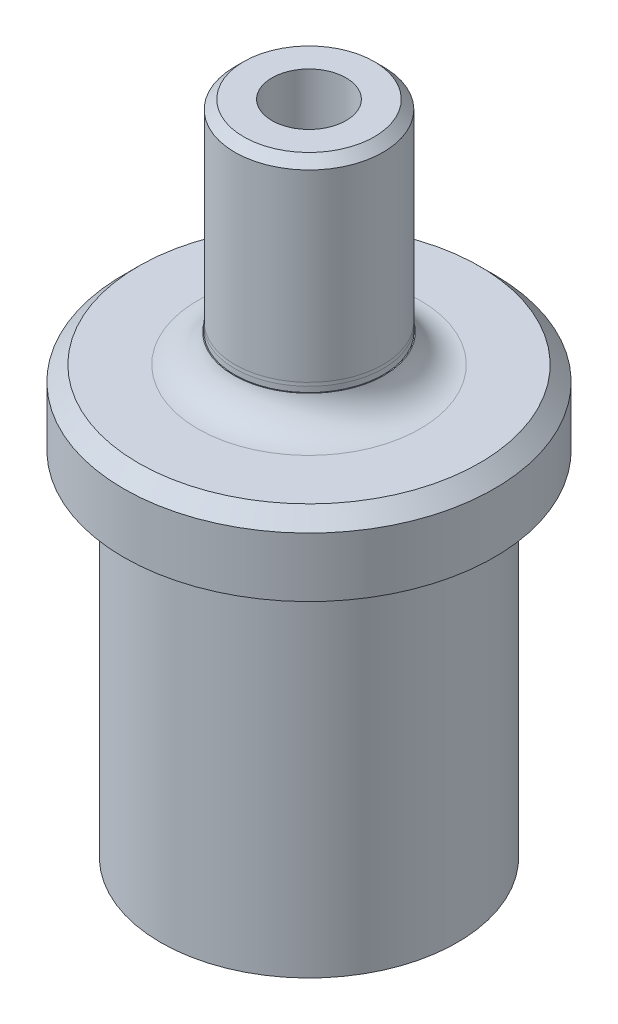
ISO-10303-21;
HEADER;
FILE_DESCRIPTION(('STEP AP214'),'2;1');
FILE_NAME('part.step','',(''),(''),'','','');
FILE_SCHEMA(('AUTOMOTIVE_DESIGN { 1 0 10303 214 1 1 1 1 }'));
ENDSEC;
DATA;
#1=APPLICATION_CONTEXT('core data for automotive mechanical design processes');
#2=APPLICATION_PROTOCOL_DEFINITION('international standard','automotive_design',2000,#1);
#3=PRODUCT_CONTEXT('',#1,'mechanical');
#4=PRODUCT('Part','Part','',(#3));
#5=PRODUCT_RELATED_PRODUCT_CATEGORY('part','',(#4));
#6=PRODUCT_DEFINITION_FORMATION('','',#4);
#7=PRODUCT_DEFINITION_CONTEXT('part definition',#1,'design');
#8=PRODUCT_DEFINITION('design','',#6,#7);
#9=PRODUCT_DEFINITION_SHAPE('','',#8);
#10=(LENGTH_UNIT() NAMED_UNIT(*) SI_UNIT(.MILLI.,.METRE.));
#11=(NAMED_UNIT(*) PLANE_ANGLE_UNIT() SI_UNIT($,.RADIAN.));
#12=(NAMED_UNIT(*) SI_UNIT($,.STERADIAN.) SOLID_ANGLE_UNIT());
#13=UNCERTAINTY_MEASURE_WITH_UNIT(LENGTH_MEASURE(1.E-05),#10,'distance_accuracy_value','');
#14=(GEOMETRIC_REPRESENTATION_CONTEXT(3) GLOBAL_UNCERTAINTY_ASSIGNED_CONTEXT((#13)) GLOBAL_UNIT_ASSIGNED_CONTEXT((#10,
#11,#12)) REPRESENTATION_CONTEXT('',''));
#15=CARTESIAN_POINT('',(0.,0.,0.));
#16=DIRECTION('',(0.,0.,1.));
#17=DIRECTION('',(1.,0.,0.));
#18=AXIS2_PLACEMENT_3D('',#15,#16,#17);
#19=CARTESIAN_POINT('',(0.,87.5665,0.));
#20=DIRECTION('',(0.,1.,0.));
#21=DIRECTION('',(0.,0.,1.));
#22=AXIS2_PLACEMENT_3D('',#19,#20,#21);
#23=CYLINDRICAL_SURFACE('',#22,1.72719999999999);
#24=CARTESIAN_POINT('',(0.,48.9775739957719,0.));
#25=DIRECTION('',(0.,1.,0.));
#26=DIRECTION('',(0.,0.,1.));
#27=AXIS2_PLACEMENT_3D('',#24,#25,#26);
#28=CIRCLE('',#27,1.72719999999999);
#29=CARTESIAN_POINT('',(0.,48.9775739957719,1.72719999999999));
#30=VERTEX_POINT('',#29);
#31=EDGE_CURVE('E367',#30,#30,#28,.T.);
#32=ORIENTED_EDGE('',*,*,#31,.T.);
#33=EDGE_LOOP('',(#32));
#34=FACE_BOUND('',#33,.T.);
#35=CARTESIAN_POINT('',(0.,19.176,0.));
#36=DIRECTION('',(0.,-1.,0.));
#37=DIRECTION('',(0.,0.,-1.));
#38=AXIS2_PLACEMENT_3D('',#35,#36,#37);
#39=CIRCLE('',#38,1.72719999999999);
#40=CARTESIAN_POINT('',(0.,19.176,-1.72719999999999));
#41=VERTEX_POINT('',#40);
#42=EDGE_CURVE('E366',#41,#41,#39,.T.);
#43=ORIENTED_EDGE('',*,*,#42,.T.);
#44=EDGE_LOOP('',(#43));
#45=FACE_BOUND('',#44,.T.);
#46=ADVANCED_FACE('F35',(#34,#45),#23,.F.);
#47=CARTESIAN_POINT('',(0.,39.6875,0.));
#48=DIRECTION('',(0.,1.,0.));
#49=DIRECTION('',(0.,0.,1.));
#50=AXIS2_PLACEMENT_3D('',#47,#48,#49);
#51=TOROIDAL_SURFACE('',#50,9.525,3.175);
#52=CARTESIAN_POINT('',(0.,36.5125,0.));
#53=DIRECTION('',(0.,1.,0.));
#54=DIRECTION('',(0.,0.,1.));
#55=AXIS2_PLACEMENT_3D('',#52,#53,#54);
#56=CIRCLE('',#55,9.525);
#57=CARTESIAN_POINT('',(0.,36.5125,9.525));
#58=VERTEX_POINT('',#57);
#59=EDGE_CURVE('E350',#58,#58,#56,.F.);
#60=ORIENTED_EDGE('',*,*,#59,.F.);
#61=EDGE_LOOP('',(#60));
#62=FACE_BOUND('',#61,.T.);
#63=CARTESIAN_POINT('',(0.,38.9382,0.));
#64=DIRECTION('',(0.,-1.,0.));
#65=DIRECTION('',(1.,0.,0.));
#66=AXIS2_PLACEMENT_3D('',#63,#64,#65);
#67=CIRCLE('',#66,6.43968405021463);
#68=CARTESIAN_POINT('',(6.43968405021463,38.9382,0.));
#69=VERTEX_POINT('',#68);
#70=EDGE_CURVE('E362',#69,#69,#67,.F.);
#71=ORIENTED_EDGE('',*,*,#70,.F.);
#72=EDGE_LOOP('',(#71));
#73=FACE_BOUND('',#72,.T.);
#74=ADVANCED_FACE('F387',(#62,#73),#51,.F.);
#75=CARTESIAN_POINT('',(0.,80.9625,0.));
#76=DIRECTION('',(0.,-1.,0.));
#77=DIRECTION('',(0.,0.,-1.));
#78=AXIS2_PLACEMENT_3D('',#75,#76,#77);
#79=CYLINDRICAL_SURFACE('',#78,15.875);
#80=CARTESIAN_POINT('',(0.,35.2425,0.));
#81=DIRECTION('',(0.,1.,0.));
#82=DIRECTION('',(0.,0.,1.));
#83=AXIS2_PLACEMENT_3D('',#80,#81,#82);
#84=CIRCLE('',#83,15.875);
#85=CARTESIAN_POINT('',(0.,35.2425,15.875));
#86=VERTEX_POINT('',#85);
#87=EDGE_CURVE('E356',#86,#86,#84,.F.);
#88=ORIENTED_EDGE('',*,*,#87,.T.);
#89=EDGE_LOOP('',(#88));
#90=FACE_BOUND('',#89,.T.);
#91=CARTESIAN_POINT('',(0.,30.1625,0.));
#92=DIRECTION('',(0.,1.,0.));
#93=DIRECTION('',(0.,0.,1.));
#94=AXIS2_PLACEMENT_3D('',#91,#92,#93);
#95=CIRCLE('',#94,15.875);
#96=CARTESIAN_POINT('',(0.,30.1625,15.875));
#97=VERTEX_POINT('',#96);
#98=EDGE_CURVE('E297',#97,#97,#95,.T.);
#99=ORIENTED_EDGE('',*,*,#98,.T.);
#100=EDGE_LOOP('',(#99));
#101=FACE_BOUND('',#100,.T.);
#102=ADVANCED_FACE('F393',(#90,#101),#79,.T.);
#103=CARTESIAN_POINT('',(0.,0.,0.));
#104=DIRECTION('',(0.,1.,0.));
#105=DIRECTION('',(0.,0.,1.));
#106=AXIS2_PLACEMENT_3D('',#103,#104,#105);
#107=PLANE('',#106);
#108=CARTESIAN_POINT('',(0.,0.,0.));
#109=DIRECTION('',(0.,1.,0.));
#110=DIRECTION('',(0.,0.,1.));
#111=AXIS2_PLACEMENT_3D('',#108,#109,#110);
#112=CIRCLE('',#111,12.7);
#113=CARTESIAN_POINT('',(0.,0.,12.7));
#114=VERTEX_POINT('',#113);
#115=EDGE_CURVE('E341',#114,#114,#112,.T.);
#116=ORIENTED_EDGE('',*,*,#115,.F.);
#117=EDGE_LOOP('',(#116));
#118=FACE_BOUND('',#117,.T.);
#119=DIRECTION('',(0.707106781186548,0.,0.707106781186547));
#120=VECTOR('',#119,1.);
#121=CARTESIAN_POINT('',(-4.94974746830584,0.,4.94974746830584));
#122=LINE('',#121,#120);
#123=CARTESIAN_POINT('',(-8.77696292147802,0.,1.12253201513365));
#124=VERTEX_POINT('',#123);
#125=CARTESIAN_POINT('',(-7.,0.,2.89949493661167));
#126=VERTEX_POINT('',#125);
#127=EDGE_CURVE('E50',#124,#126,#122,.T.);
#128=ORIENTED_EDGE('',*,*,#127,.T.);
#129=DIRECTION('',(0.,0.,1.));
#130=VECTOR('',#129,1.);
#131=CARTESIAN_POINT('',(-7.,0.,0.));
#132=LINE('',#131,#130);
#133=CARTESIAN_POINT('',(-7.,0.,5.4125));
#134=VERTEX_POINT('',#133);
#135=EDGE_CURVE('E136',#126,#134,#132,.T.);
#136=ORIENTED_EDGE('',*,*,#135,.T.);
#137=CARTESIAN_POINT('',(-5.4125,0.,5.4125));
#138=DIRECTION('',(0.,-1.,0.));
#139=DIRECTION('',(0.,0.,-1.));
#140=AXIS2_PLACEMENT_3D('',#137,#138,#139);
#141=CIRCLE('',#140,1.5875);
#142=CARTESIAN_POINT('',(-5.4125,0.,7.));
#143=VERTEX_POINT('',#142);
#144=EDGE_CURVE('E291',#143,#134,#141,.T.);
#145=ORIENTED_EDGE('',*,*,#144,.F.);
#146=DIRECTION('',(1.,0.,0.));
#147=VECTOR('',#146,1.);
#148=CARTESIAN_POINT('',(0.,0.,7.));
#149=LINE('',#148,#147);
#150=CARTESIAN_POINT('',(-2.89949493661167,0.,7.));
#151=VERTEX_POINT('',#150);
#152=EDGE_CURVE('E208',#143,#151,#149,.T.);
#153=ORIENTED_EDGE('',*,*,#152,.T.);
#154=DIRECTION('',(0.707106781186548,0.,0.707106781186547));
#155=VECTOR('',#154,1.);
#156=CARTESIAN_POINT('',(-4.94974746830584,0.,4.94974746830584));
#157=LINE('',#156,#155);
#158=CARTESIAN_POINT('',(-1.12253201513365,0.,8.77696292147802));
#159=VERTEX_POINT('',#158);
#160=EDGE_CURVE('E287',#151,#159,#157,.T.);
#161=ORIENTED_EDGE('',*,*,#160,.T.);
#162=CARTESIAN_POINT('',(0.,0.,7.65443090634438));
#163=DIRECTION('',(0.,-1.,0.));
#164=DIRECTION('',(0.,0.,-1.));
#165=AXIS2_PLACEMENT_3D('',#162,#163,#164);
#166=CIRCLE('',#165,1.5875);
#167=CARTESIAN_POINT('',(1.12253201513365,0.,8.77696292147801));
#168=VERTEX_POINT('',#167);
#169=EDGE_CURVE('E284',#168,#159,#166,.T.);
#170=ORIENTED_EDGE('',*,*,#169,.F.);
#171=DIRECTION('',(0.707106781186548,0.,-0.707106781186548));
#172=VECTOR('',#171,1.);
#173=CARTESIAN_POINT('',(4.94974746830583,0.,4.94974746830583));
#174=LINE('',#173,#172);
#175=CARTESIAN_POINT('',(2.89949493661166,0.,7.));
#176=VERTEX_POINT('',#175);
#177=EDGE_CURVE('E281',#168,#176,#174,.T.);
#178=ORIENTED_EDGE('',*,*,#177,.T.);
#179=DIRECTION('',(1.,0.,0.));
#180=VECTOR('',#179,1.);
#181=CARTESIAN_POINT('',(0.,0.,7.));
#182=LINE('',#181,#180);
#183=CARTESIAN_POINT('',(5.4125,0.,7.));
#184=VERTEX_POINT('',#183);
#185=EDGE_CURVE('E278',#176,#184,#182,.T.);
#186=ORIENTED_EDGE('',*,*,#185,.T.);
#187=CARTESIAN_POINT('',(5.4125,0.,5.4125));
#188=DIRECTION('',(0.,-1.,0.));
#189=DIRECTION('',(0.,0.,-1.));
#190=AXIS2_PLACEMENT_3D('',#187,#188,#189);
#191=CIRCLE('',#190,1.5875);
#192=CARTESIAN_POINT('',(7.,0.,5.4125));
#193=VERTEX_POINT('',#192);
#194=EDGE_CURVE('E275',#193,#184,#191,.T.);
#195=ORIENTED_EDGE('',*,*,#194,.F.);
#196=DIRECTION('',(0.,0.,1.));
#197=VECTOR('',#196,1.);
#198=CARTESIAN_POINT('',(7.,0.,0.));
#199=LINE('',#198,#197);
#200=CARTESIAN_POINT('',(7.,0.,2.89949493661167));
#201=VERTEX_POINT('',#200);
#202=EDGE_CURVE('E272',#201,#193,#199,.T.);
#203=ORIENTED_EDGE('',*,*,#202,.F.);
#204=DIRECTION('',(0.707106781186548,0.,-0.707106781186548));
#205=VECTOR('',#204,1.);
#206=CARTESIAN_POINT('',(4.94974746830583,0.,4.94974746830583));
#207=LINE('',#206,#205);
#208=CARTESIAN_POINT('',(8.77696292147802,0.,1.12253201513365));
#209=VERTEX_POINT('',#208);
#210=EDGE_CURVE('E269',#201,#209,#207,.T.);
#211=ORIENTED_EDGE('',*,*,#210,.T.);
#212=CARTESIAN_POINT('',(7.65443090634438,0.,0.));
#213=DIRECTION('',(0.,-1.,0.));
#214=DIRECTION('',(0.,0.,-1.));
#215=AXIS2_PLACEMENT_3D('',#212,#213,#214);
#216=CIRCLE('',#215,1.5875);
#217=CARTESIAN_POINT('',(8.77696292147801,0.,-1.12253201513364));
#218=VERTEX_POINT('',#217);
#219=EDGE_CURVE('E266',#218,#209,#216,.T.);
#220=ORIENTED_EDGE('',*,*,#219,.F.);
#221=DIRECTION('',(0.707106781186548,0.,0.707106781186548));
#222=VECTOR('',#221,1.);
#223=CARTESIAN_POINT('',(4.94974746830583,0.,-4.94974746830583));
#224=LINE('',#223,#222);
#225=CARTESIAN_POINT('',(7.,0.,-2.89949493661165));
#226=VERTEX_POINT('',#225);
#227=EDGE_CURVE('E263',#226,#218,#224,.T.);
#228=ORIENTED_EDGE('',*,*,#227,.F.);
#229=DIRECTION('',(0.,0.,1.));
#230=VECTOR('',#229,1.);
#231=CARTESIAN_POINT('',(7.,0.,0.));
#232=LINE('',#231,#230);
#233=CARTESIAN_POINT('',(7.,0.,-5.4125));
#234=VERTEX_POINT('',#233);
#235=EDGE_CURVE('E260',#234,#226,#232,.T.);
#236=ORIENTED_EDGE('',*,*,#235,.F.);
#237=CARTESIAN_POINT('',(5.4125,0.,-5.4125));
#238=DIRECTION('',(0.,-1.,0.));
#239=DIRECTION('',(0.,0.,-1.));
#240=AXIS2_PLACEMENT_3D('',#237,#238,#239);
#241=CIRCLE('',#240,1.5875);
#242=CARTESIAN_POINT('',(5.4125,0.,-7.));
#243=VERTEX_POINT('',#242);
#244=EDGE_CURVE('E257',#243,#234,#241,.T.);
#245=ORIENTED_EDGE('',*,*,#244,.F.);
#246=DIRECTION('',(1.,0.,0.));
#247=VECTOR('',#246,1.);
#248=CARTESIAN_POINT('',(0.,0.,-7.));
#249=LINE('',#248,#247);
#250=CARTESIAN_POINT('',(2.89949493661166,0.,-7.));
#251=VERTEX_POINT('',#250);
#252=EDGE_CURVE('E254',#251,#243,#249,.T.);
#253=ORIENTED_EDGE('',*,*,#252,.F.);
#254=DIRECTION('',(0.707106781186548,0.,0.707106781186548));
#255=VECTOR('',#254,1.);
#256=CARTESIAN_POINT('',(4.94974746830583,0.,-4.94974746830583));
#257=LINE('',#256,#255);
#258=CARTESIAN_POINT('',(1.12253201513364,0.,-8.77696292147802));
#259=VERTEX_POINT('',#258);
#260=EDGE_CURVE('E251',#259,#251,#257,.T.);
#261=ORIENTED_EDGE('',*,*,#260,.F.);
#262=CARTESIAN_POINT('',(0.,0.,-7.65443090634438));
#263=DIRECTION('',(0.,-1.,0.));
#264=DIRECTION('',(0.,0.,-1.));
#265=AXIS2_PLACEMENT_3D('',#262,#263,#264);
#266=CIRCLE('',#265,1.5875);
#267=CARTESIAN_POINT('',(-1.12253201513365,0.,-8.77696292147802));
#268=VERTEX_POINT('',#267);
#269=EDGE_CURVE('E248',#268,#259,#266,.T.);
#270=ORIENTED_EDGE('',*,*,#269,.F.);
#271=DIRECTION('',(0.707106781186547,0.,-0.707106781186548));
#272=VECTOR('',#271,1.);
#273=CARTESIAN_POINT('',(-4.94974746830583,0.,-4.94974746830583));
#274=LINE('',#273,#272);
#275=CARTESIAN_POINT('',(-2.89949493661167,0.,-7.));
#276=VERTEX_POINT('',#275);
#277=EDGE_CURVE('E245',#276,#268,#274,.T.);
#278=ORIENTED_EDGE('',*,*,#277,.F.);
#279=DIRECTION('',(1.,0.,0.));
#280=VECTOR('',#279,1.);
#281=CARTESIAN_POINT('',(0.,0.,-7.));
#282=LINE('',#281,#280);
#283=CARTESIAN_POINT('',(-5.4125,0.,-7.));
#284=VERTEX_POINT('',#283);
#285=EDGE_CURVE('E242',#284,#276,#282,.T.);
#286=ORIENTED_EDGE('',*,*,#285,.F.);
#287=CARTESIAN_POINT('',(-5.4125,0.,-5.4125));
#288=DIRECTION('',(0.,-1.,0.));
#289=DIRECTION('',(0.,0.,-1.));
#290=AXIS2_PLACEMENT_3D('',#287,#288,#289);
#291=CIRCLE('',#290,1.5875);
#292=CARTESIAN_POINT('',(-7.,0.,-5.4125));
#293=VERTEX_POINT('',#292);
#294=EDGE_CURVE('E239',#293,#284,#291,.T.);
#295=ORIENTED_EDGE('',*,*,#294,.F.);
#296=DIRECTION('',(0.,0.,1.));
#297=VECTOR('',#296,1.);
#298=CARTESIAN_POINT('',(-7.,0.,0.));
#299=LINE('',#298,#297);
#300=CARTESIAN_POINT('',(-7.,0.,-2.89949493661167));
#301=VERTEX_POINT('',#300);
#302=EDGE_CURVE('E236',#293,#301,#299,.T.);
#303=ORIENTED_EDGE('',*,*,#302,.T.);
#304=DIRECTION('',(0.707106781186547,0.,-0.707106781186548));
#305=VECTOR('',#304,1.);
#306=CARTESIAN_POINT('',(-4.94974746830583,0.,-4.94974746830583));
#307=LINE('',#306,#305);
#308=CARTESIAN_POINT('',(-8.77696292147803,0.,-1.12253201513364));
#309=VERTEX_POINT('',#308);
#310=EDGE_CURVE('E233',#309,#301,#307,.T.);
#311=ORIENTED_EDGE('',*,*,#310,.F.);
#312=CARTESIAN_POINT('',(-7.65443090634438,0.,0.));
#313=DIRECTION('',(0.,-1.,0.));
#314=DIRECTION('',(0.,0.,-1.));
#315=AXIS2_PLACEMENT_3D('',#312,#313,#314);
#316=CIRCLE('',#315,1.5875);
#317=EDGE_CURVE('E229',#124,#309,#316,.T.);
#318=ORIENTED_EDGE('',*,*,#317,.F.);
#319=EDGE_LOOP('',(#128,#136,#145,#153,#161,#170,#178,#186,#195,#203,#211,#220,#228,#236,#245,
#253,#261,#270,#278,#286,#295,#303,#311,#318));
#320=FACE_BOUND('',#319,.T.);
#321=ADVANCED_FACE('F510',(#118,#320),#107,.F.);
#322=CARTESIAN_POINT('',(0.,30.1625,0.));
#323=DIRECTION('',(0.,-1.,0.));
#324=DIRECTION('',(0.,0.,-1.));
#325=AXIS2_PLACEMENT_3D('',#322,#323,#324);
#326=CYLINDRICAL_SURFACE('',#325,12.7);
#327=CARTESIAN_POINT('',(0.,30.1625,0.));
#328=DIRECTION('',(0.,1.,0.));
#329=DIRECTION('',(0.,0.,1.));
#330=AXIS2_PLACEMENT_3D('',#327,#328,#329);
#331=CIRCLE('',#330,12.7);
#332=CARTESIAN_POINT('',(0.,30.1625,12.7));
#333=VERTEX_POINT('',#332);
#334=EDGE_CURVE('E342',#333,#333,#331,.T.);
#335=ORIENTED_EDGE('',*,*,#334,.F.);
#336=EDGE_LOOP('',(#335));
#337=FACE_BOUND('',#336,.T.);
#338=ORIENTED_EDGE('',*,*,#115,.T.);
#339=EDGE_LOOP('',(#338));
#340=FACE_BOUND('',#339,.T.);
#341=ADVANCED_FACE('F506',(#337,#340),#326,.T.);
#342=CARTESIAN_POINT('',(0.,30.1625,0.));
#343=DIRECTION('',(0.,1.,0.));
#344=DIRECTION('',(0.,0.,1.));
#345=AXIS2_PLACEMENT_3D('',#342,#343,#344);
#346=PLANE('',#345);
#347=ORIENTED_EDGE('',*,*,#334,.T.);
#348=EDGE_LOOP('',(#347));
#349=FACE_BOUND('',#348,.T.);
#350=ORIENTED_EDGE('',*,*,#98,.F.);
#351=EDGE_LOOP('',(#350));
#352=FACE_BOUND('',#351,.T.);
#353=ADVANCED_FACE('F503',(#349,#352),#346,.F.);
#354=CARTESIAN_POINT('',(-4.94974746830584,11.176,4.94974746830584));
#355=DIRECTION('',(0.707106781186548,0.,-0.707106781186548));
#356=DIRECTION('',(-0.707106781186548,0.,-0.707106781186547));
#357=AXIS2_PLACEMENT_3D('',#354,#355,#356);
#358=PLANE('',#357);
#359=ORIENTED_EDGE('',*,*,#127,.F.);
#360=DIRECTION('',(0.,-1.,0.));
#361=VECTOR('',#360,1.);
#362=CARTESIAN_POINT('',(-8.77696292147802,11.176,1.12253201513365));
#363=LINE('',#362,#361);
#364=CARTESIAN_POINT('',(-8.77696292147802,11.176,1.12253201513365));
#365=VERTEX_POINT('',#364);
#366=EDGE_CURVE('E139',#365,#124,#363,.T.);
#367=ORIENTED_EDGE('',*,*,#366,.F.);
#368=DIRECTION('',(0.707106781186548,0.,0.707106781186547));
#369=VECTOR('',#368,1.);
#370=CARTESIAN_POINT('',(-4.94974746830584,11.176,4.94974746830584));
#371=LINE('',#370,#369);
#372=CARTESIAN_POINT('',(-7.,11.176,2.89949493661167));
#373=VERTEX_POINT('',#372);
#374=EDGE_CURVE('E294',#365,#373,#371,.T.);
#375=ORIENTED_EDGE('',*,*,#374,.T.);
#376=DIRECTION('',(0.,-1.,0.));
#377=VECTOR('',#376,1.);
#378=CARTESIAN_POINT('',(-7.,11.176,2.89949493661167));
#379=LINE('',#378,#377);
#380=EDGE_CURVE('E295',#373,#126,#379,.T.);
#381=ORIENTED_EDGE('',*,*,#380,.T.);
#382=EDGE_LOOP('',(#359,#367,#375,#381));
#383=FACE_BOUND('',#382,.T.);
#384=ADVANCED_FACE('F417',(#383),#358,.T.);
#385=CARTESIAN_POINT('',(-7.,11.176,0.));
#386=DIRECTION('',(1.,0.,0.));
#387=DIRECTION('',(0.,0.,-1.));
#388=AXIS2_PLACEMENT_3D('',#385,#386,#387);
#389=PLANE('',#388);
#390=ORIENTED_EDGE('',*,*,#135,.F.);
#391=ORIENTED_EDGE('',*,*,#380,.F.);
#392=DIRECTION('',(0.,0.,1.));
#393=VECTOR('',#392,1.);
#394=CARTESIAN_POINT('',(-7.,11.176,0.));
#395=LINE('',#394,#393);
#396=CARTESIAN_POINT('',(-7.,11.176,5.4125));
#397=VERTEX_POINT('',#396);
#398=EDGE_CURVE('E59',#373,#397,#395,.T.);
#399=ORIENTED_EDGE('',*,*,#398,.T.);
#400=DIRECTION('',(0.,-1.,0.));
#401=VECTOR('',#400,1.);
#402=CARTESIAN_POINT('',(-7.,11.176,5.4125));
#403=LINE('',#402,#401);
#404=EDGE_CURVE('E213',#397,#134,#403,.T.);
#405=ORIENTED_EDGE('',*,*,#404,.T.);
#406=EDGE_LOOP('',(#390,#391,#399,#405));
#407=FACE_BOUND('',#406,.T.);
#408=ADVANCED_FACE('F414',(#407),#389,.T.);
#409=CARTESIAN_POINT('',(-5.4125,11.176,5.4125));
#410=DIRECTION('',(0.,-1.,0.));
#411=DIRECTION('',(0.,0.,-1.));
#412=AXIS2_PLACEMENT_3D('',#409,#410,#411);
#413=CYLINDRICAL_SURFACE('',#412,1.5875);
#414=ORIENTED_EDGE('',*,*,#144,.T.);
#415=ORIENTED_EDGE('',*,*,#404,.F.);
#416=CARTESIAN_POINT('',(-5.4125,11.176,5.4125));
#417=DIRECTION('',(0.,-1.,0.));
#418=DIRECTION('',(0.,0.,-1.));
#419=AXIS2_PLACEMENT_3D('',#416,#417,#418);
#420=CIRCLE('',#419,1.5875);
#421=CARTESIAN_POINT('',(-5.4125,11.176,7.));
#422=VERTEX_POINT('',#421);
#423=EDGE_CURVE('E218',#422,#397,#420,.T.);
#424=ORIENTED_EDGE('',*,*,#423,.F.);
#425=DIRECTION('',(0.,-1.,0.));
#426=VECTOR('',#425,1.);
#427=CARTESIAN_POINT('',(-5.4125,11.176,7.));
#428=LINE('',#427,#426);
#429=EDGE_CURVE('E202',#422,#143,#428,.T.);
#430=ORIENTED_EDGE('',*,*,#429,.T.);
#431=EDGE_LOOP('',(#414,#415,#424,#430));
#432=FACE_BOUND('',#431,.T.);
#433=ADVANCED_FACE('F223',(#432),#413,.F.);
#434=CARTESIAN_POINT('',(0.,11.176,7.));
#435=DIRECTION('',(0.,0.,-1.));
#436=DIRECTION('',(-1.,0.,0.));
#437=AXIS2_PLACEMENT_3D('',#434,#435,#436);
#438=PLANE('',#437);
#439=ORIENTED_EDGE('',*,*,#152,.F.);
#440=ORIENTED_EDGE('',*,*,#429,.F.);
#441=DIRECTION('',(1.,0.,0.));
#442=VECTOR('',#441,1.);
#443=CARTESIAN_POINT('',(0.,11.176,7.));
#444=LINE('',#443,#442);
#445=CARTESIAN_POINT('',(-2.89949493661167,11.176,7.));
#446=VERTEX_POINT('',#445);
#447=EDGE_CURVE('E205',#422,#446,#444,.T.);
#448=ORIENTED_EDGE('',*,*,#447,.T.);
#449=DIRECTION('',(0.,-1.,0.));
#450=VECTOR('',#449,1.);
#451=CARTESIAN_POINT('',(-2.89949493661167,11.176,7.));
#452=LINE('',#451,#450);
#453=EDGE_CURVE('E214',#446,#151,#452,.T.);
#454=ORIENTED_EDGE('',*,*,#453,.T.);
#455=EDGE_LOOP('',(#439,#440,#448,#454));
#456=FACE_BOUND('',#455,.T.);
#457=ADVANCED_FACE('F204',(#456),#438,.T.);
#458=CARTESIAN_POINT('',(-4.94974746830584,11.176,4.94974746830584));
#459=DIRECTION('',(0.707106781186548,0.,-0.707106781186548));
#460=DIRECTION('',(-0.707106781186548,0.,-0.707106781186547));
#461=AXIS2_PLACEMENT_3D('',#458,#459,#460);
#462=PLANE('',#461);
#463=ORIENTED_EDGE('',*,*,#160,.F.);
#464=ORIENTED_EDGE('',*,*,#453,.F.);
#465=DIRECTION('',(0.707106781186548,0.,0.707106781186547));
#466=VECTOR('',#465,1.);
#467=CARTESIAN_POINT('',(-4.94974746830584,11.176,4.94974746830584));
#468=LINE('',#467,#466);
#469=CARTESIAN_POINT('',(-1.12253201513365,11.176,8.77696292147802));
#470=VERTEX_POINT('',#469);
#471=EDGE_CURVE('E220',#446,#470,#468,.T.);
#472=ORIENTED_EDGE('',*,*,#471,.T.);
#473=DIRECTION('',(0.,-1.,0.));
#474=VECTOR('',#473,1.);
#475=CARTESIAN_POINT('',(-1.12253201513365,11.176,8.77696292147802));
#476=LINE('',#475,#474);
#477=EDGE_CURVE('E300',#470,#159,#476,.T.);
#478=ORIENTED_EDGE('',*,*,#477,.T.);
#479=EDGE_LOOP('',(#463,#464,#472,#478));
#480=FACE_BOUND('',#479,.T.);
#481=ADVANCED_FACE('F422',(#480),#462,.T.);
#482=CARTESIAN_POINT('',(0.,11.176,7.65443090634438));
#483=DIRECTION('',(0.,-1.,0.));
#484=DIRECTION('',(0.,0.,-1.));
#485=AXIS2_PLACEMENT_3D('',#482,#483,#484);
#486=CYLINDRICAL_SURFACE('',#485,1.5875);
#487=ORIENTED_EDGE('',*,*,#169,.T.);
#488=ORIENTED_EDGE('',*,*,#477,.F.);
#489=CARTESIAN_POINT('',(0.,11.176,7.65443090634438));
#490=DIRECTION('',(0.,-1.,0.));
#491=DIRECTION('',(0.,0.,-1.));
#492=AXIS2_PLACEMENT_3D('',#489,#490,#491);
#493=CIRCLE('',#492,1.5875);
#494=CARTESIAN_POINT('',(1.12253201513365,11.176,8.77696292147801));
#495=VERTEX_POINT('',#494);
#496=EDGE_CURVE('E909',#495,#470,#493,.T.);
#497=ORIENTED_EDGE('',*,*,#496,.F.);
#498=DIRECTION('',(0.,-1.,0.));
#499=VECTOR('',#498,1.);
#500=CARTESIAN_POINT('',(1.12253201513365,11.176,8.77696292147801));
#501=LINE('',#500,#499);
#502=EDGE_CURVE('E302',#495,#168,#501,.T.);
#503=ORIENTED_EDGE('',*,*,#502,.T.);
#504=EDGE_LOOP('',(#487,#488,#497,#503));
#505=FACE_BOUND('',#504,.T.);
#506=ADVANCED_FACE('F425',(#505),#486,.F.);
#507=CARTESIAN_POINT('',(4.94974746830583,11.176,4.94974746830583));
#508=DIRECTION('',(-0.707106781186548,0.,-0.707106781186548));
#509=DIRECTION('',(-0.707106781186548,0.,0.707106781186548));
#510=AXIS2_PLACEMENT_3D('',#507,#508,#509);
#511=PLANE('',#510);
#512=ORIENTED_EDGE('',*,*,#177,.F.);
#513=ORIENTED_EDGE('',*,*,#502,.F.);
#514=DIRECTION('',(0.707106781186548,0.,-0.707106781186548));
#515=VECTOR('',#514,1.);
#516=CARTESIAN_POINT('',(4.94974746830583,11.176,4.94974746830583));
#517=LINE('',#516,#515);
#518=CARTESIAN_POINT('',(2.89949493661166,11.176,7.));
#519=VERTEX_POINT('',#518);
#520=EDGE_CURVE('E907',#495,#519,#517,.T.);
#521=ORIENTED_EDGE('',*,*,#520,.T.);
#522=DIRECTION('',(0.,-1.,0.));
#523=VECTOR('',#522,1.);
#524=CARTESIAN_POINT('',(2.89949493661166,11.176,7.));
#525=LINE('',#524,#523);
#526=EDGE_CURVE('E304',#519,#176,#525,.T.);
#527=ORIENTED_EDGE('',*,*,#526,.T.);
#528=EDGE_LOOP('',(#512,#513,#521,#527));
#529=FACE_BOUND('',#528,.T.);
#530=ADVANCED_FACE('F429',(#529),#511,.T.);
#531=CARTESIAN_POINT('',(0.,11.176,7.));
#532=DIRECTION('',(0.,0.,-1.));
#533=DIRECTION('',(-1.,0.,0.));
#534=AXIS2_PLACEMENT_3D('',#531,#532,#533);
#535=PLANE('',#534);
#536=ORIENTED_EDGE('',*,*,#185,.F.);
#537=ORIENTED_EDGE('',*,*,#526,.F.);
#538=DIRECTION('',(1.,0.,0.));
#539=VECTOR('',#538,1.);
#540=CARTESIAN_POINT('',(0.,11.176,7.));
#541=LINE('',#540,#539);
#542=CARTESIAN_POINT('',(5.4125,11.176,7.));
#543=VERTEX_POINT('',#542);
#544=EDGE_CURVE('E905',#519,#543,#541,.T.);
#545=ORIENTED_EDGE('',*,*,#544,.T.);
#546=DIRECTION('',(0.,-1.,0.));
#547=VECTOR('',#546,1.);
#548=CARTESIAN_POINT('',(5.4125,11.176,7.));
#549=LINE('',#548,#547);
#550=EDGE_CURVE('E306',#543,#184,#549,.T.);
#551=ORIENTED_EDGE('',*,*,#550,.T.);
#552=EDGE_LOOP('',(#536,#537,#545,#551));
#553=FACE_BOUND('',#552,.T.);
#554=ADVANCED_FACE('F433',(#553),#535,.T.);
#555=CARTESIAN_POINT('',(5.4125,11.176,5.4125));
#556=DIRECTION('',(0.,-1.,0.));
#557=DIRECTION('',(0.,0.,-1.));
#558=AXIS2_PLACEMENT_3D('',#555,#556,#557);
#559=CYLINDRICAL_SURFACE('',#558,1.5875);
#560=ORIENTED_EDGE('',*,*,#194,.T.);
#561=ORIENTED_EDGE('',*,*,#550,.F.);
#562=CARTESIAN_POINT('',(5.4125,11.176,5.4125));
#563=DIRECTION('',(0.,-1.,0.));
#564=DIRECTION('',(0.,0.,-1.));
#565=AXIS2_PLACEMENT_3D('',#562,#563,#564);
#566=CIRCLE('',#565,1.5875);
#567=CARTESIAN_POINT('',(7.,11.176,5.4125));
#568=VERTEX_POINT('',#567);
#569=EDGE_CURVE('E902',#568,#543,#566,.T.);
#570=ORIENTED_EDGE('',*,*,#569,.F.);
#571=DIRECTION('',(0.,-1.,0.));
#572=VECTOR('',#571,1.);
#573=CARTESIAN_POINT('',(7.,11.176,5.4125));
#574=LINE('',#573,#572);
#575=EDGE_CURVE('E308',#568,#193,#574,.T.);
#576=ORIENTED_EDGE('',*,*,#575,.T.);
#577=EDGE_LOOP('',(#560,#561,#570,#576));
#578=FACE_BOUND('',#577,.T.);
#579=ADVANCED_FACE('F437',(#578),#559,.F.);
#580=CARTESIAN_POINT('',(7.,11.176,0.));
#581=DIRECTION('',(1.,0.,0.));
#582=DIRECTION('',(0.,0.,-1.));
#583=AXIS2_PLACEMENT_3D('',#580,#581,#582);
#584=PLANE('',#583);
#585=ORIENTED_EDGE('',*,*,#202,.T.);
#586=ORIENTED_EDGE('',*,*,#575,.F.);
#587=DIRECTION('',(0.,0.,1.));
#588=VECTOR('',#587,1.);
#589=CARTESIAN_POINT('',(7.,11.176,0.));
#590=LINE('',#589,#588);
#591=CARTESIAN_POINT('',(7.,11.176,2.89949493661167));
#592=VERTEX_POINT('',#591);
#593=EDGE_CURVE('E899',#592,#568,#590,.T.);
#594=ORIENTED_EDGE('',*,*,#593,.F.);
#595=DIRECTION('',(0.,-1.,0.));
#596=VECTOR('',#595,1.);
#597=CARTESIAN_POINT('',(7.,11.176,2.89949493661167));
#598=LINE('',#597,#596);
#599=EDGE_CURVE('E310',#592,#201,#598,.T.);
#600=ORIENTED_EDGE('',*,*,#599,.T.);
#601=EDGE_LOOP('',(#585,#586,#594,#600));
#602=FACE_BOUND('',#601,.T.);
#603=ADVANCED_FACE('F441',(#602),#584,.F.);
#604=CARTESIAN_POINT('',(4.94974746830583,11.176,4.94974746830583));
#605=DIRECTION('',(-0.707106781186548,0.,-0.707106781186548));
#606=DIRECTION('',(-0.707106781186548,0.,0.707106781186548));
#607=AXIS2_PLACEMENT_3D('',#604,#605,#606);
#608=PLANE('',#607);
#609=ORIENTED_EDGE('',*,*,#210,.F.);
#610=ORIENTED_EDGE('',*,*,#599,.F.);
#611=DIRECTION('',(0.707106781186548,0.,-0.707106781186548));
#612=VECTOR('',#611,1.);
#613=CARTESIAN_POINT('',(4.94974746830583,11.176,4.94974746830583));
#614=LINE('',#613,#612);
#615=CARTESIAN_POINT('',(8.77696292147802,11.176,1.12253201513365));
#616=VERTEX_POINT('',#615);
#617=EDGE_CURVE('E897',#592,#616,#614,.T.);
#618=ORIENTED_EDGE('',*,*,#617,.T.);
#619=DIRECTION('',(0.,-1.,0.));
#620=VECTOR('',#619,1.);
#621=CARTESIAN_POINT('',(8.77696292147802,11.176,1.12253201513365));
#622=LINE('',#621,#620);
#623=EDGE_CURVE('E312',#616,#209,#622,.T.);
#624=ORIENTED_EDGE('',*,*,#623,.T.);
#625=EDGE_LOOP('',(#609,#610,#618,#624));
#626=FACE_BOUND('',#625,.T.);
#627=ADVANCED_FACE('F445',(#626),#608,.T.);
#628=CARTESIAN_POINT('',(7.65443090634438,11.176,0.));
#629=DIRECTION('',(0.,-1.,0.));
#630=DIRECTION('',(0.,0.,-1.));
#631=AXIS2_PLACEMENT_3D('',#628,#629,#630);
#632=CYLINDRICAL_SURFACE('',#631,1.5875);
#633=ORIENTED_EDGE('',*,*,#219,.T.);
#634=ORIENTED_EDGE('',*,*,#623,.F.);
#635=CARTESIAN_POINT('',(7.65443090634438,11.176,0.));
#636=DIRECTION('',(0.,-1.,0.));
#637=DIRECTION('',(0.,0.,-1.));
#638=AXIS2_PLACEMENT_3D('',#635,#636,#637);
#639=CIRCLE('',#638,1.5875);
#640=CARTESIAN_POINT('',(8.77696292147801,11.176,-1.12253201513364));
#641=VERTEX_POINT('',#640);
#642=EDGE_CURVE('E894',#641,#616,#639,.T.);
#643=ORIENTED_EDGE('',*,*,#642,.F.);
#644=DIRECTION('',(0.,-1.,0.));
#645=VECTOR('',#644,1.);
#646=CARTESIAN_POINT('',(8.77696292147801,11.176,-1.12253201513364));
#647=LINE('',#646,#645);
#648=EDGE_CURVE('E314',#641,#218,#647,.T.);
#649=ORIENTED_EDGE('',*,*,#648,.T.);
#650=EDGE_LOOP('',(#633,#634,#643,#649));
#651=FACE_BOUND('',#650,.T.);
#652=ADVANCED_FACE('F449',(#651),#632,.F.);
#653=CARTESIAN_POINT('',(4.94974746830583,11.176,-4.94974746830583));
#654=DIRECTION('',(0.707106781186548,0.,-0.707106781186548));
#655=DIRECTION('',(-0.707106781186548,0.,-0.707106781186548));
#656=AXIS2_PLACEMENT_3D('',#653,#654,#655);
#657=PLANE('',#656);
#658=ORIENTED_EDGE('',*,*,#227,.T.);
#659=ORIENTED_EDGE('',*,*,#648,.F.);
#660=DIRECTION('',(0.707106781186548,0.,0.707106781186548));
#661=VECTOR('',#660,1.);
#662=CARTESIAN_POINT('',(4.94974746830583,11.176,-4.94974746830583));
#663=LINE('',#662,#661);
#664=CARTESIAN_POINT('',(7.,11.176,-2.89949493661165));
#665=VERTEX_POINT('',#664);
#666=EDGE_CURVE('E891',#665,#641,#663,.T.);
#667=ORIENTED_EDGE('',*,*,#666,.F.);
#668=DIRECTION('',(0.,-1.,0.));
#669=VECTOR('',#668,1.);
#670=CARTESIAN_POINT('',(7.,11.176,-2.89949493661165));
#671=LINE('',#670,#669);
#672=EDGE_CURVE('E316',#665,#226,#671,.T.);
#673=ORIENTED_EDGE('',*,*,#672,.T.);
#674=EDGE_LOOP('',(#658,#659,#667,#673));
#675=FACE_BOUND('',#674,.T.);
#676=ADVANCED_FACE('F453',(#675),#657,.F.);
#677=CARTESIAN_POINT('',(7.,11.176,0.));
#678=DIRECTION('',(1.,0.,0.));
#679=DIRECTION('',(0.,0.,-1.));
#680=AXIS2_PLACEMENT_3D('',#677,#678,#679);
#681=PLANE('',#680);
#682=ORIENTED_EDGE('',*,*,#235,.T.);
#683=ORIENTED_EDGE('',*,*,#672,.F.);
#684=DIRECTION('',(0.,0.,1.));
#685=VECTOR('',#684,1.);
#686=CARTESIAN_POINT('',(7.,11.176,0.));
#687=LINE('',#686,#685);
#688=CARTESIAN_POINT('',(7.,11.176,-5.4125));
#689=VERTEX_POINT('',#688);
#690=EDGE_CURVE('E888',#689,#665,#687,.T.);
#691=ORIENTED_EDGE('',*,*,#690,.F.);
#692=DIRECTION('',(0.,-1.,0.));
#693=VECTOR('',#692,1.);
#694=CARTESIAN_POINT('',(7.,11.176,-5.4125));
#695=LINE('',#694,#693);
#696=EDGE_CURVE('E318',#689,#234,#695,.T.);
#697=ORIENTED_EDGE('',*,*,#696,.T.);
#698=EDGE_LOOP('',(#682,#683,#691,#697));
#699=FACE_BOUND('',#698,.T.);
#700=ADVANCED_FACE('F457',(#699),#681,.F.);
#701=CARTESIAN_POINT('',(5.4125,11.176,-5.4125));
#702=DIRECTION('',(0.,-1.,0.));
#703=DIRECTION('',(0.,0.,-1.));
#704=AXIS2_PLACEMENT_3D('',#701,#702,#703);
#705=CYLINDRICAL_SURFACE('',#704,1.5875);
#706=ORIENTED_EDGE('',*,*,#244,.T.);
#707=ORIENTED_EDGE('',*,*,#696,.F.);
#708=CARTESIAN_POINT('',(5.4125,11.176,-5.4125));
#709=DIRECTION('',(0.,-1.,0.));
#710=DIRECTION('',(0.,0.,-1.));
#711=AXIS2_PLACEMENT_3D('',#708,#709,#710);
#712=CIRCLE('',#711,1.5875);
#713=CARTESIAN_POINT('',(5.4125,11.176,-7.));
#714=VERTEX_POINT('',#713);
#715=EDGE_CURVE('E885',#714,#689,#712,.T.);
#716=ORIENTED_EDGE('',*,*,#715,.F.);
#717=DIRECTION('',(0.,-1.,0.));
#718=VECTOR('',#717,1.);
#719=CARTESIAN_POINT('',(5.4125,11.176,-7.));
#720=LINE('',#719,#718);
#721=EDGE_CURVE('E320',#714,#243,#720,.T.);
#722=ORIENTED_EDGE('',*,*,#721,.T.);
#723=EDGE_LOOP('',(#706,#707,#716,#722));
#724=FACE_BOUND('',#723,.T.);
#725=ADVANCED_FACE('F461',(#724),#705,.F.);
#726=CARTESIAN_POINT('',(0.,11.176,-7.));
#727=DIRECTION('',(0.,0.,-1.));
#728=DIRECTION('',(-1.,0.,0.));
#729=AXIS2_PLACEMENT_3D('',#726,#727,#728);
#730=PLANE('',#729);
#731=ORIENTED_EDGE('',*,*,#252,.T.);
#732=ORIENTED_EDGE('',*,*,#721,.F.);
#733=DIRECTION('',(1.,0.,0.));
#734=VECTOR('',#733,1.);
#735=CARTESIAN_POINT('',(0.,11.176,-7.));
#736=LINE('',#735,#734);
#737=CARTESIAN_POINT('',(2.89949493661166,11.176,-7.));
#738=VERTEX_POINT('',#737);
#739=EDGE_CURVE('E882',#738,#714,#736,.T.);
#740=ORIENTED_EDGE('',*,*,#739,.F.);
#741=DIRECTION('',(0.,-1.,0.));
#742=VECTOR('',#741,1.);
#743=CARTESIAN_POINT('',(2.89949493661166,11.176,-7.));
#744=LINE('',#743,#742);
#745=EDGE_CURVE('E322',#738,#251,#744,.T.);
#746=ORIENTED_EDGE('',*,*,#745,.T.);
#747=EDGE_LOOP('',(#731,#732,#740,#746));
#748=FACE_BOUND('',#747,.T.);
#749=ADVANCED_FACE('F465',(#748),#730,.F.);
#750=CARTESIAN_POINT('',(4.94974746830583,11.176,-4.94974746830583));
#751=DIRECTION('',(0.707106781186548,0.,-0.707106781186548));
#752=DIRECTION('',(-0.707106781186548,0.,-0.707106781186548));
#753=AXIS2_PLACEMENT_3D('',#750,#751,#752);
#754=PLANE('',#753);
#755=ORIENTED_EDGE('',*,*,#260,.T.);
#756=ORIENTED_EDGE('',*,*,#745,.F.);
#757=DIRECTION('',(0.707106781186548,0.,0.707106781186548));
#758=VECTOR('',#757,1.);
#759=CARTESIAN_POINT('',(4.94974746830583,11.176,-4.94974746830583));
#760=LINE('',#759,#758);
#761=CARTESIAN_POINT('',(1.12253201513364,11.176,-8.77696292147802));
#762=VERTEX_POINT('',#761);
#763=EDGE_CURVE('E879',#762,#738,#760,.T.);
#764=ORIENTED_EDGE('',*,*,#763,.F.);
#765=DIRECTION('',(0.,-1.,0.));
#766=VECTOR('',#765,1.);
#767=CARTESIAN_POINT('',(1.12253201513364,11.176,-8.77696292147802));
#768=LINE('',#767,#766);
#769=EDGE_CURVE('E324',#762,#259,#768,.T.);
#770=ORIENTED_EDGE('',*,*,#769,.T.);
#771=EDGE_LOOP('',(#755,#756,#764,#770));
#772=FACE_BOUND('',#771,.T.);
#773=ADVANCED_FACE('F469',(#772),#754,.F.);
#774=CARTESIAN_POINT('',(0.,11.176,-7.65443090634438));
#775=DIRECTION('',(0.,-1.,0.));
#776=DIRECTION('',(0.,0.,-1.));
#777=AXIS2_PLACEMENT_3D('',#774,#775,#776);
#778=CYLINDRICAL_SURFACE('',#777,1.5875);
#779=ORIENTED_EDGE('',*,*,#269,.T.);
#780=ORIENTED_EDGE('',*,*,#769,.F.);
#781=CARTESIAN_POINT('',(0.,11.176,-7.65443090634438));
#782=DIRECTION('',(0.,-1.,0.));
#783=DIRECTION('',(0.,0.,-1.));
#784=AXIS2_PLACEMENT_3D('',#781,#782,#783);
#785=CIRCLE('',#784,1.5875);
#786=CARTESIAN_POINT('',(-1.12253201513365,11.176,-8.77696292147802));
#787=VERTEX_POINT('',#786);
#788=EDGE_CURVE('E876',#787,#762,#785,.T.);
#789=ORIENTED_EDGE('',*,*,#788,.F.);
#790=DIRECTION('',(0.,-1.,0.));
#791=VECTOR('',#790,1.);
#792=CARTESIAN_POINT('',(-1.12253201513365,11.176,-8.77696292147802));
#793=LINE('',#792,#791);
#794=EDGE_CURVE('E326',#787,#268,#793,.T.);
#795=ORIENTED_EDGE('',*,*,#794,.T.);
#796=EDGE_LOOP('',(#779,#780,#789,#795));
#797=FACE_BOUND('',#796,.T.);
#798=ADVANCED_FACE('F473',(#797),#778,.F.);
#799=CARTESIAN_POINT('',(-4.94974746830583,11.176,-4.94974746830583));
#800=DIRECTION('',(-0.707106781186548,0.,-0.707106781186548));
#801=DIRECTION('',(-0.707106781186547,0.,0.707106781186548));
#802=AXIS2_PLACEMENT_3D('',#799,#800,#801);
#803=PLANE('',#802);
#804=ORIENTED_EDGE('',*,*,#277,.T.);
#805=ORIENTED_EDGE('',*,*,#794,.F.);
#806=DIRECTION('',(0.707106781186547,0.,-0.707106781186548));
#807=VECTOR('',#806,1.);
#808=CARTESIAN_POINT('',(-4.94974746830583,11.176,-4.94974746830583));
#809=LINE('',#808,#807);
#810=CARTESIAN_POINT('',(-2.89949493661167,11.176,-7.));
#811=VERTEX_POINT('',#810);
#812=EDGE_CURVE('E873',#811,#787,#809,.T.);
#813=ORIENTED_EDGE('',*,*,#812,.F.);
#814=DIRECTION('',(0.,-1.,0.));
#815=VECTOR('',#814,1.);
#816=CARTESIAN_POINT('',(-2.89949493661167,11.176,-7.));
#817=LINE('',#816,#815);
#818=EDGE_CURVE('E328',#811,#276,#817,.T.);
#819=ORIENTED_EDGE('',*,*,#818,.T.);
#820=EDGE_LOOP('',(#804,#805,#813,#819));
#821=FACE_BOUND('',#820,.T.);
#822=ADVANCED_FACE('F477',(#821),#803,.F.);
#823=CARTESIAN_POINT('',(0.,11.176,-7.));
#824=DIRECTION('',(0.,0.,-1.));
#825=DIRECTION('',(-1.,0.,0.));
#826=AXIS2_PLACEMENT_3D('',#823,#824,#825);
#827=PLANE('',#826);
#828=ORIENTED_EDGE('',*,*,#285,.T.);
#829=ORIENTED_EDGE('',*,*,#818,.F.);
#830=DIRECTION('',(1.,0.,0.));
#831=VECTOR('',#830,1.);
#832=CARTESIAN_POINT('',(0.,11.176,-7.));
#833=LINE('',#832,#831);
#834=CARTESIAN_POINT('',(-5.4125,11.176,-7.));
#835=VERTEX_POINT('',#834);
#836=EDGE_CURVE('E870',#835,#811,#833,.T.);
#837=ORIENTED_EDGE('',*,*,#836,.F.);
#838=DIRECTION('',(0.,-1.,0.));
#839=VECTOR('',#838,1.);
#840=CARTESIAN_POINT('',(-5.4125,11.176,-7.));
#841=LINE('',#840,#839);
#842=EDGE_CURVE('E330',#835,#284,#841,.T.);
#843=ORIENTED_EDGE('',*,*,#842,.T.);
#844=EDGE_LOOP('',(#828,#829,#837,#843));
#845=FACE_BOUND('',#844,.T.);
#846=ADVANCED_FACE('F481',(#845),#827,.F.);
#847=CARTESIAN_POINT('',(-5.4125,11.176,-5.4125));
#848=DIRECTION('',(0.,-1.,0.));
#849=DIRECTION('',(0.,0.,-1.));
#850=AXIS2_PLACEMENT_3D('',#847,#848,#849);
#851=CYLINDRICAL_SURFACE('',#850,1.5875);
#852=ORIENTED_EDGE('',*,*,#294,.T.);
#853=ORIENTED_EDGE('',*,*,#842,.F.);
#854=CARTESIAN_POINT('',(-5.4125,11.176,-5.4125));
#855=DIRECTION('',(0.,-1.,0.));
#856=DIRECTION('',(0.,0.,-1.));
#857=AXIS2_PLACEMENT_3D('',#854,#855,#856);
#858=CIRCLE('',#857,1.5875);
#859=CARTESIAN_POINT('',(-7.,11.176,-5.4125));
#860=VERTEX_POINT('',#859);
#861=EDGE_CURVE('E867',#860,#835,#858,.T.);
#862=ORIENTED_EDGE('',*,*,#861,.F.);
#863=DIRECTION('',(0.,-1.,0.));
#864=VECTOR('',#863,1.);
#865=CARTESIAN_POINT('',(-7.,11.176,-5.4125));
#866=LINE('',#865,#864);
#867=EDGE_CURVE('E332',#860,#293,#866,.T.);
#868=ORIENTED_EDGE('',*,*,#867,.T.);
#869=EDGE_LOOP('',(#852,#853,#862,#868));
#870=FACE_BOUND('',#869,.T.);
#871=ADVANCED_FACE('F485',(#870),#851,.F.);
#872=CARTESIAN_POINT('',(-7.,11.176,0.));
#873=DIRECTION('',(1.,0.,0.));
#874=DIRECTION('',(0.,0.,-1.));
#875=AXIS2_PLACEMENT_3D('',#872,#873,#874);
#876=PLANE('',#875);
#877=ORIENTED_EDGE('',*,*,#302,.F.);
#878=ORIENTED_EDGE('',*,*,#867,.F.);
#879=DIRECTION('',(0.,0.,1.));
#880=VECTOR('',#879,1.);
#881=CARTESIAN_POINT('',(-7.,11.176,0.));
#882=LINE('',#881,#880);
#883=CARTESIAN_POINT('',(-7.,11.176,-2.89949493661167));
#884=VERTEX_POINT('',#883);
#885=EDGE_CURVE('E865',#860,#884,#882,.T.);
#886=ORIENTED_EDGE('',*,*,#885,.T.);
#887=DIRECTION('',(0.,-1.,0.));
#888=VECTOR('',#887,1.);
#889=CARTESIAN_POINT('',(-7.,11.176,-2.89949493661167));
#890=LINE('',#889,#888);
#891=EDGE_CURVE('E334',#884,#301,#890,.T.);
#892=ORIENTED_EDGE('',*,*,#891,.T.);
#893=EDGE_LOOP('',(#877,#878,#886,#892));
#894=FACE_BOUND('',#893,.T.);
#895=ADVANCED_FACE('F489',(#894),#876,.T.);
#896=CARTESIAN_POINT('',(-4.94974746830583,11.176,-4.94974746830583));
#897=DIRECTION('',(-0.707106781186548,0.,-0.707106781186548));
#898=DIRECTION('',(-0.707106781186547,0.,0.707106781186548));
#899=AXIS2_PLACEMENT_3D('',#896,#897,#898);
#900=PLANE('',#899);
#901=ORIENTED_EDGE('',*,*,#310,.T.);
#902=ORIENTED_EDGE('',*,*,#891,.F.);
#903=DIRECTION('',(0.707106781186547,0.,-0.707106781186548));
#904=VECTOR('',#903,1.);
#905=CARTESIAN_POINT('',(-4.94974746830583,11.176,-4.94974746830583));
#906=LINE('',#905,#904);
#907=CARTESIAN_POINT('',(-8.77696292147803,11.176,-1.12253201513364));
#908=VERTEX_POINT('',#907);
#909=EDGE_CURVE('E862',#908,#884,#906,.T.);
#910=ORIENTED_EDGE('',*,*,#909,.F.);
#911=DIRECTION('',(0.,-1.,0.));
#912=VECTOR('',#911,1.);
#913=CARTESIAN_POINT('',(-8.77696292147803,11.176,-1.12253201513364));
#914=LINE('',#913,#912);
#915=EDGE_CURVE('E336',#908,#309,#914,.T.);
#916=ORIENTED_EDGE('',*,*,#915,.T.);
#917=EDGE_LOOP('',(#901,#902,#910,#916));
#918=FACE_BOUND('',#917,.T.);
#919=ADVANCED_FACE('F493',(#918),#900,.F.);
#920=CARTESIAN_POINT('',(-7.65443090634438,11.176,0.));
#921=DIRECTION('',(0.,-1.,0.));
#922=DIRECTION('',(0.,0.,-1.));
#923=AXIS2_PLACEMENT_3D('',#920,#921,#922);
#924=CYLINDRICAL_SURFACE('',#923,1.5875);
#925=ORIENTED_EDGE('',*,*,#317,.T.);
#926=ORIENTED_EDGE('',*,*,#915,.F.);
#927=CARTESIAN_POINT('',(-7.65443090634438,11.176,0.));
#928=DIRECTION('',(0.,-1.,0.));
#929=DIRECTION('',(0.,0.,-1.));
#930=AXIS2_PLACEMENT_3D('',#927,#928,#929);
#931=CIRCLE('',#930,1.5875);
#932=EDGE_CURVE('E859',#365,#908,#931,.T.);
#933=ORIENTED_EDGE('',*,*,#932,.F.);
#934=ORIENTED_EDGE('',*,*,#366,.T.);
#935=EDGE_LOOP('',(#925,#926,#933,#934));
#936=FACE_BOUND('',#935,.T.);
#937=ADVANCED_FACE('F412',(#936),#924,.F.);
#938=CARTESIAN_POINT('',(0.,11.176,0.));
#939=DIRECTION('',(0.,-1.,0.));
#940=DIRECTION('',(0.,0.,-1.));
#941=AXIS2_PLACEMENT_3D('',#938,#939,#940);
#942=PLANE('',#941);
#943=CARTESIAN_POINT('',(0.,11.176,0.));
#944=DIRECTION('',(0.,-1.,0.));
#945=DIRECTION('',(0.,0.,-1.));
#946=AXIS2_PLACEMENT_3D('',#943,#944,#945);
#947=CIRCLE('',#946,6.);
#948=CARTESIAN_POINT('',(0.,11.176,-6.));
#949=VERTEX_POINT('',#948);
#950=EDGE_CURVE('E853',#949,#949,#947,.T.);
#951=ORIENTED_EDGE('',*,*,#950,.F.);
#952=EDGE_LOOP('',(#951));
#953=FACE_BOUND('',#952,.T.);
#954=ORIENTED_EDGE('',*,*,#374,.F.);
#955=ORIENTED_EDGE('',*,*,#932,.T.);
#956=ORIENTED_EDGE('',*,*,#909,.T.);
#957=ORIENTED_EDGE('',*,*,#885,.F.);
#958=ORIENTED_EDGE('',*,*,#861,.T.);
#959=ORIENTED_EDGE('',*,*,#836,.T.);
#960=ORIENTED_EDGE('',*,*,#812,.T.);
#961=ORIENTED_EDGE('',*,*,#788,.T.);
#962=ORIENTED_EDGE('',*,*,#763,.T.);
#963=ORIENTED_EDGE('',*,*,#739,.T.);
#964=ORIENTED_EDGE('',*,*,#715,.T.);
#965=ORIENTED_EDGE('',*,*,#690,.T.);
#966=ORIENTED_EDGE('',*,*,#666,.T.);
#967=ORIENTED_EDGE('',*,*,#642,.T.);
#968=ORIENTED_EDGE('',*,*,#617,.F.);
#969=ORIENTED_EDGE('',*,*,#593,.T.);
#970=ORIENTED_EDGE('',*,*,#569,.T.);
#971=ORIENTED_EDGE('',*,*,#544,.F.);
#972=ORIENTED_EDGE('',*,*,#520,.F.);
#973=ORIENTED_EDGE('',*,*,#496,.T.);
#974=ORIENTED_EDGE('',*,*,#471,.F.);
#975=ORIENTED_EDGE('',*,*,#447,.F.);
#976=ORIENTED_EDGE('',*,*,#423,.T.);
#977=ORIENTED_EDGE('',*,*,#398,.F.);
#978=EDGE_LOOP('',(#954,#955,#956,#957,#958,#959,#960,#961,#962,#963,#964,#965,#966,#967,#968,
#969,#970,#971,#972,#973,#974,#975,#976,#977));
#979=FACE_BOUND('',#978,.T.);
#980=ADVANCED_FACE('F217',(#953,#979),#942,.T.);
#981=CARTESIAN_POINT('',(0.,19.176,0.));
#982=DIRECTION('',(0.,-1.,0.));
#983=DIRECTION('',(0.,0.,-1.));
#984=AXIS2_PLACEMENT_3D('',#981,#982,#983);
#985=CYLINDRICAL_SURFACE('',#984,6.);
#986=CARTESIAN_POINT('',(0.,19.176,0.));
#987=DIRECTION('',(0.,-1.,0.));
#988=DIRECTION('',(0.,0.,-1.));
#989=AXIS2_PLACEMENT_3D('',#986,#987,#988);
#990=CIRCLE('',#989,6.);
#991=CARTESIAN_POINT('',(0.,19.176,-6.));
#992=VERTEX_POINT('',#991);
#993=EDGE_CURVE('E230',#992,#992,#990,.T.);
#994=ORIENTED_EDGE('',*,*,#993,.F.);
#995=EDGE_LOOP('',(#994));
#996=FACE_BOUND('',#995,.T.);
#997=ORIENTED_EDGE('',*,*,#950,.T.);
#998=EDGE_LOOP('',(#997));
#999=FACE_BOUND('',#998,.T.);
#1000=ADVANCED_FACE('F405',(#996,#999),#985,.F.);
#1001=CARTESIAN_POINT('',(0.,19.176,0.));
#1002=DIRECTION('',(0.,-1.,0.));
#1003=DIRECTION('',(0.,0.,-1.));
#1004=AXIS2_PLACEMENT_3D('',#1001,#1002,#1003);
#1005=PLANE('',#1004);
#1006=ORIENTED_EDGE('',*,*,#42,.F.);
#1007=EDGE_LOOP('',(#1006));
#1008=FACE_BOUND('',#1007,.T.);
#1009=ORIENTED_EDGE('',*,*,#993,.T.);
#1010=EDGE_LOOP('',(#1009));
#1011=FACE_BOUND('',#1010,.T.);
#1012=ADVANCED_FACE('F402',(#1008,#1011),#1005,.T.);
#1013=CARTESIAN_POINT('',(0.,36.5125,0.));
#1014=DIRECTION('',(0.,1.,0.));
#1015=DIRECTION('',(0.,0.,1.));
#1016=AXIS2_PLACEMENT_3D('',#1013,#1014,#1015);
#1017=PLANE('',#1016);
#1018=CARTESIAN_POINT('',(0.,36.5125,0.));
#1019=DIRECTION('',(0.,1.,0.));
#1020=DIRECTION('',(0.,0.,1.));
#1021=AXIS2_PLACEMENT_3D('',#1018,#1019,#1020);
#1022=CIRCLE('',#1021,14.605);
#1023=CARTESIAN_POINT('',(0.,36.5125,14.605));
#1024=VERTEX_POINT('',#1023);
#1025=EDGE_CURVE('E353',#1024,#1024,#1022,.T.);
#1026=ORIENTED_EDGE('',*,*,#1025,.T.);
#1027=EDGE_LOOP('',(#1026));
#1028=FACE_BOUND('',#1027,.T.);
#1029=ORIENTED_EDGE('',*,*,#59,.T.);
#1030=EDGE_LOOP('',(#1029));
#1031=FACE_BOUND('',#1030,.T.);
#1032=ADVANCED_FACE('F400',(#1028,#1031),#1017,.T.);
#1033=CARTESIAN_POINT('',(0.,36.5125,0.));
#1034=DIRECTION('',(0.,-1.,0.));
#1035=DIRECTION('',(0.,0.,-1.));
#1036=AXIS2_PLACEMENT_3D('',#1033,#1034,#1035);
#1037=CONICAL_SURFACE('',#1036,14.605,0.785398163397443);
#1038=ORIENTED_EDGE('',*,*,#87,.F.);
#1039=EDGE_LOOP('',(#1038));
#1040=FACE_BOUND('',#1039,.T.);
#1041=ORIENTED_EDGE('',*,*,#1025,.F.);
#1042=EDGE_LOOP('',(#1041));
#1043=FACE_BOUND('',#1042,.T.);
#1044=ADVANCED_FACE('F517',(#1040,#1043),#1037,.T.);
#1045=CARTESIAN_POINT('',(0.,87.5665,0.));
#1046=DIRECTION('',(0.,1.,0.));
#1047=DIRECTION('',(-1.,0.,0.));
#1048=AXIS2_PLACEMENT_3D('',#1045,#1046,#1047);
#1049=CYLINDRICAL_SURFACE('',#1048,6.3627);
#1050=CARTESIAN_POINT('',(0.,38.9382,0.));
#1051=DIRECTION('',(0.,1.,0.));
#1052=DIRECTION('',(-1.,0.,0.));
#1053=AXIS2_PLACEMENT_3D('',#1050,#1051,#1052);
#1054=CIRCLE('',#1053,6.3627);
#1055=CARTESIAN_POINT('',(-6.36269999999999,38.9382,0.));
#1056=VERTEX_POINT('',#1055);
#1057=EDGE_CURVE('E363',#1056,#1056,#1054,.T.);
#1058=ORIENTED_EDGE('',*,*,#1057,.T.);
#1059=EDGE_LOOP('',(#1058));
#1060=FACE_BOUND('',#1059,.T.);
#1061=CARTESIAN_POINT('',(0.,39.4038034896231,0.));
#1062=DIRECTION('',(0.,1.,0.));
#1063=DIRECTION('',(0.,0.,1.));
#1064=AXIS2_PLACEMENT_3D('',#1061,#1062,#1063);
#1065=CIRCLE('',#1064,6.3627);
#1066=CARTESIAN_POINT('',(0.,39.4038034896231,6.3627));
#1067=VERTEX_POINT('',#1066);
#1068=EDGE_CURVE('E359',#1067,#1067,#1065,.F.);
#1069=ORIENTED_EDGE('',*,*,#1068,.T.);
#1070=EDGE_LOOP('',(#1069));
#1071=FACE_BOUND('',#1070,.T.);
#1072=ADVANCED_FACE('F519',(#1060,#1071),#1049,.T.);
#1073=CARTESIAN_POINT('',(0.,38.9382,0.));
#1074=DIRECTION('',(0.,1.,0.));
#1075=DIRECTION('',(-1.,0.,0.));
#1076=AXIS2_PLACEMENT_3D('',#1073,#1074,#1075);
#1077=PLANE('',#1076);
#1078=ORIENTED_EDGE('',*,*,#1057,.F.);
#1079=EDGE_LOOP('',(#1078));
#1080=FACE_BOUND('',#1079,.T.);
#1081=ORIENTED_EDGE('',*,*,#70,.T.);
#1082=EDGE_LOOP('',(#1081));
#1083=FACE_BOUND('',#1082,.T.);
#1084=ADVANCED_FACE('F525',(#1080,#1083),#1077,.T.);
#1085=CARTESIAN_POINT('',(0.,56.1975,0.));
#1086=DIRECTION('',(0.,1.,0.));
#1087=DIRECTION('',(-1.,0.,0.));
#1088=AXIS2_PLACEMENT_3D('',#1085,#1086,#1087);
#1089=PLANE('',#1088);
#1090=CARTESIAN_POINT('',(0.,56.1975,0.));
#1091=DIRECTION('',(0.,1.,0.));
#1092=DIRECTION('',(-1.,0.,0.));
#1093=AXIS2_PLACEMENT_3D('',#1090,#1091,#1092);
#1094=CIRCLE('',#1093,5.58799999999996);
#1095=CARTESIAN_POINT('',(-5.58799999999996,56.1975,0.));
#1096=VERTEX_POINT('',#1095);
#1097=EDGE_CURVE('E11',#1096,#1096,#1094,.T.);
#1098=ORIENTED_EDGE('',*,*,#1097,.T.);
#1099=EDGE_LOOP('',(#1098));
#1100=FACE_BOUND('',#1099,.T.);
#1101=CARTESIAN_POINT('',(0.,56.1975,0.));
#1102=DIRECTION('',(0.,1.,0.));
#1103=DIRECTION('',(0.,0.,1.));
#1104=AXIS2_PLACEMENT_3D('',#1101,#1102,#1103);
#1105=CIRCLE('',#1104,3.17499999999999);
#1106=CARTESIAN_POINT('',(0.,56.1975,3.17499999999999));
#1107=VERTEX_POINT('',#1106);
#1108=EDGE_CURVE('E844',#1107,#1107,#1105,.T.);
#1109=ORIENTED_EDGE('',*,*,#1108,.F.);
#1110=EDGE_LOOP('',(#1109));
#1111=FACE_BOUND('',#1110,.T.);
#1112=ADVANCED_FACE('F538',(#1100,#1111),#1089,.T.);
#1113=CARTESIAN_POINT('',(0.,39.6875,0.));
#1114=DIRECTION('',(0.,1.,0.));
#1115=DIRECTION('',(0.,0.,1.));
#1116=AXIS2_PLACEMENT_3D('',#1113,#1114,#1115);
#1117=CIRCLE('',#1116,6.35);
#1118=CARTESIAN_POINT('',(0.,39.6875,6.35));
#1119=VERTEX_POINT('',#1118);
#1120=EDGE_CURVE('E345',#1119,#1119,#1117,.T.);
#1121=ORIENTED_EDGE('',*,*,#1120,.F.);
#1122=EDGE_LOOP('',(#1121));
#1123=FACE_BOUND('',#1122,.T.);
#1124=ORIENTED_EDGE('',*,*,#1068,.F.);
#1125=EDGE_LOOP('',(#1124));
#1126=FACE_BOUND('',#1125,.T.);
#1127=ADVANCED_FACE('F396',(#1123,#1126),#51,.F.);
#1128=CARTESIAN_POINT('',(0.,36.5125,0.));
#1129=DIRECTION('',(0.,1.,0.));
#1130=DIRECTION('',(0.,0.,1.));
#1131=AXIS2_PLACEMENT_3D('',#1128,#1129,#1130);
#1132=CYLINDRICAL_SURFACE('',#1131,6.35);
#1133=CARTESIAN_POINT('',(0.,55.4354999999999,0.));
#1134=DIRECTION('',(0.,1.,0.));
#1135=DIRECTION('',(0.,0.,1.));
#1136=AXIS2_PLACEMENT_3D('',#1133,#1134,#1135);
#1137=CIRCLE('',#1136,6.35);
#1138=CARTESIAN_POINT('',(0.,55.4354999999999,6.35));
#1139=VERTEX_POINT('',#1138);
#1140=EDGE_CURVE('E43',#1139,#1139,#1137,.F.);
#1141=ORIENTED_EDGE('',*,*,#1140,.T.);
#1142=EDGE_LOOP('',(#1141));
#1143=FACE_BOUND('',#1142,.T.);
#1144=ORIENTED_EDGE('',*,*,#1120,.T.);
#1145=EDGE_LOOP('',(#1144));
#1146=FACE_BOUND('',#1145,.T.);
#1147=ADVANCED_FACE('F373',(#1143,#1146),#1132,.T.);
#1148=CARTESIAN_POINT('',(0.,49.8475,0.));
#1149=DIRECTION('',(0.,1.,0.));
#1150=DIRECTION('',(0.,0.,1.));
#1151=AXIS2_PLACEMENT_3D('',#1148,#1149,#1150);
#1152=CONICAL_SURFACE('',#1151,3.175,1.02974425867665);
#1153=CARTESIAN_POINT('',(0.,49.8475,0.));
#1154=DIRECTION('',(0.,1.,0.));
#1155=DIRECTION('',(0.,0.,1.));
#1156=AXIS2_PLACEMENT_3D('',#1153,#1154,#1155);
#1157=CIRCLE('',#1156,3.175);
#1158=CARTESIAN_POINT('',(0.,49.8475,3.175));
#1159=VERTEX_POINT('',#1158);
#1160=EDGE_CURVE('E369',#1159,#1159,#1157,.T.);
#1161=ORIENTED_EDGE('',*,*,#1160,.T.);
#1162=EDGE_LOOP('',(#1161));
#1163=FACE_BOUND('',#1162,.T.);
#1164=ORIENTED_EDGE('',*,*,#31,.F.);
#1165=EDGE_LOOP('',(#1164));
#1166=FACE_BOUND('',#1165,.T.);
#1167=ADVANCED_FACE('F382',(#1163,#1166),#1152,.F.);
#1168=CARTESIAN_POINT('',(0.,56.1975,0.));
#1169=DIRECTION('',(0.,1.,0.));
#1170=DIRECTION('',(0.,0.,1.));
#1171=AXIS2_PLACEMENT_3D('',#1168,#1169,#1170);
#1172=CYLINDRICAL_SURFACE('',#1171,3.17499999999999);
#1173=ORIENTED_EDGE('',*,*,#1160,.F.);
#1174=EDGE_LOOP('',(#1173));
#1175=FACE_BOUND('',#1174,.T.);
#1176=ORIENTED_EDGE('',*,*,#1108,.T.);
#1177=EDGE_LOOP('',(#1176));
#1178=FACE_BOUND('',#1177,.T.);
#1179=ADVANCED_FACE('F377',(#1175,#1178),#1172,.F.);
#1180=CARTESIAN_POINT('',(0.,55.4354999999999,0.));
#1181=DIRECTION('',(0.,-1.,0.));
#1182=DIRECTION('',(0.,0.,-1.));
#1183=AXIS2_PLACEMENT_3D('',#1180,#1181,#1182);
#1184=CONICAL_SURFACE('',#1183,6.35,0.785398163397443);
#1185=ORIENTED_EDGE('',*,*,#1097,.F.);
#1186=EDGE_LOOP('',(#1185));
#1187=FACE_BOUND('',#1186,.T.);
#1188=ORIENTED_EDGE('',*,*,#1140,.F.);
#1189=EDGE_LOOP('',(#1188));
#1190=FACE_BOUND('',#1189,.T.);
#1191=ADVANCED_FACE('F37',(#1187,#1190),#1184,.T.);
#1192=CLOSED_SHELL('',(#46,#74,#102,#321,#341,#353,#384,#408,#433,#457,#481,#506,#530,#554,#579,
#603,#627,#652,#676,#700,#725,#749,#773,#798,#822,#846,#871,#895,#919,#937,#980,#1000,#1012,
#1032,#1044,#1072,#1084,#1112,#1127,#1147,#1167,#1179,#1191));
#1193=MANIFOLD_SOLID_BREP('B2',#1192);
#1194=ADVANCED_BREP_SHAPE_REPRESENTATION('',(#18,#1193),#14);
#1195=SHAPE_DEFINITION_REPRESENTATION(#9,#1194);
ENDSEC;
END-ISO-10303-21;
